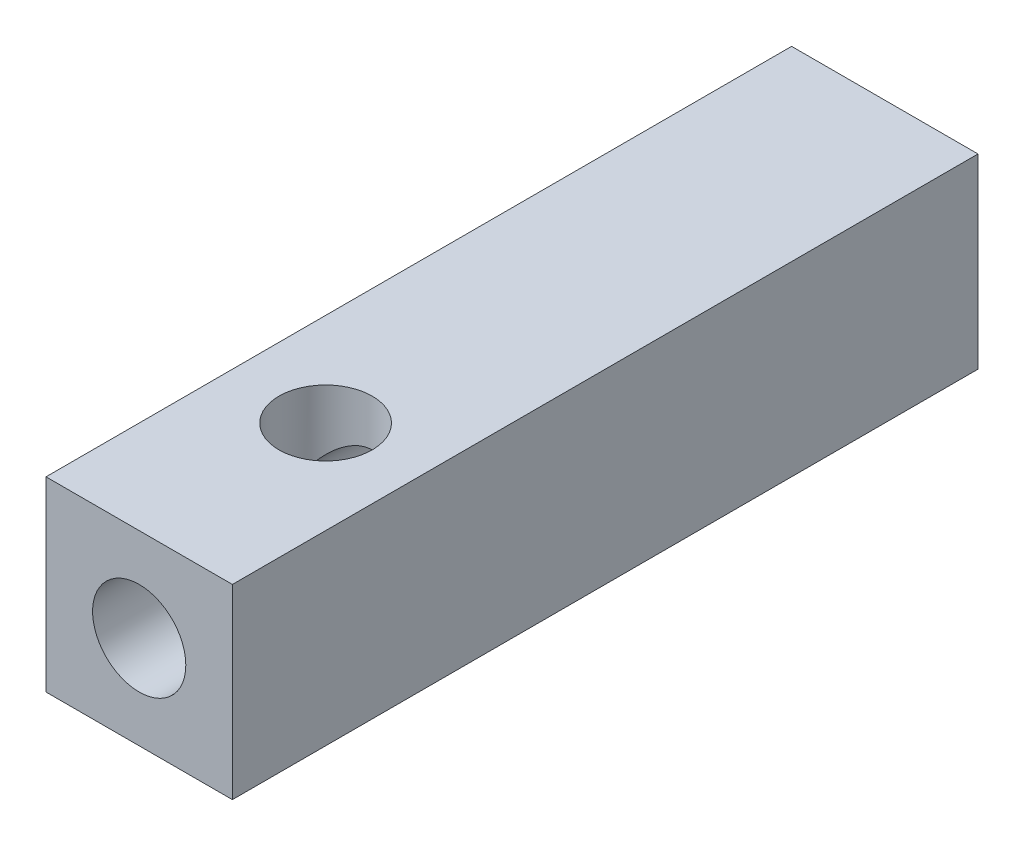
ISO-10303-21;
HEADER;
FILE_DESCRIPTION(('STEP AP214'),'2;1');
FILE_NAME('part.step','',(''),(''),'','','');
FILE_SCHEMA(('AUTOMOTIVE_DESIGN { 1 0 10303 214 1 1 1 1 }'));
ENDSEC;
DATA;
#1=APPLICATION_CONTEXT('core data for automotive mechanical design processes');
#2=APPLICATION_PROTOCOL_DEFINITION('international standard','automotive_design',2000,#1);
#3=PRODUCT_CONTEXT('',#1,'mechanical');
#4=PRODUCT('Part','Part','',(#3));
#5=PRODUCT_RELATED_PRODUCT_CATEGORY('part','',(#4));
#6=PRODUCT_DEFINITION_FORMATION('','',#4);
#7=PRODUCT_DEFINITION_CONTEXT('part definition',#1,'design');
#8=PRODUCT_DEFINITION('design','',#6,#7);
#9=PRODUCT_DEFINITION_SHAPE('','',#8);
#10=(LENGTH_UNIT() NAMED_UNIT(*) SI_UNIT(.MILLI.,.METRE.));
#11=(NAMED_UNIT(*) PLANE_ANGLE_UNIT() SI_UNIT($,.RADIAN.));
#12=(NAMED_UNIT(*) SI_UNIT($,.STERADIAN.) SOLID_ANGLE_UNIT());
#13=UNCERTAINTY_MEASURE_WITH_UNIT(LENGTH_MEASURE(1.E-05),#10,'distance_accuracy_value','');
#14=(GEOMETRIC_REPRESENTATION_CONTEXT(3) GLOBAL_UNCERTAINTY_ASSIGNED_CONTEXT((#13)) GLOBAL_UNIT_ASSIGNED_CONTEXT((#10,
#11,#12)) REPRESENTATION_CONTEXT('',''));
#15=CARTESIAN_POINT('',(0.,0.,0.));
#16=DIRECTION('',(0.,0.,1.));
#17=DIRECTION('',(1.,0.,0.));
#18=AXIS2_PLACEMENT_3D('',#15,#16,#17);
#19=CARTESIAN_POINT('',(-5.00000000000012,-5.00000000000142,39.9999999999999));
#20=DIRECTION('',(0.,0.,-1.00000000000001));
#21=DIRECTION('',(-0.999999999999996,0.,0.));
#22=AXIS2_PLACEMENT_3D('',#19,#20,#21);
#23=PLANE('',#22);
#24=DIRECTION('',(0.,1.,0.));
#25=VECTOR('',#24,1.);
#26=CARTESIAN_POINT('',(-5.00000000000012,-5.00000000000142,39.9999999999999));
#27=LINE('',#26,#25);
#28=CARTESIAN_POINT('',(-5.00000000000039,-15.0000000000028,39.9999999999999));
#29=VERTEX_POINT('',#28);
#30=CARTESIAN_POINT('',(-5.00000000000012,-5.00000000000142,39.9999999999999));
#31=VERTEX_POINT('',#30);
#32=EDGE_CURVE('E100',#29,#31,#27,.T.);
#33=ORIENTED_EDGE('',*,*,#32,.F.);
#34=DIRECTION('',(-0.999999999999996,0.,0.));
#35=VECTOR('',#34,1.);
#36=CARTESIAN_POINT('',(-5.00000000000039,-15.0000000000028,39.9999999999999));
#37=LINE('',#36,#35);
#38=CARTESIAN_POINT('',(4.99999999999956,-15.0000000000014,40.));
#39=VERTEX_POINT('',#38);
#40=EDGE_CURVE('E109',#39,#29,#37,.T.);
#41=ORIENTED_EDGE('',*,*,#40,.F.);
#42=DIRECTION('',(0.,-1.,0.));
#43=VECTOR('',#42,1.);
#44=CARTESIAN_POINT('',(4.99999999999978,-5.00000000000153,40.));
#45=LINE('',#44,#43);
#46=CARTESIAN_POINT('',(4.99999999999978,-5.00000000000153,40.));
#47=VERTEX_POINT('',#46);
#48=EDGE_CURVE('E106',#47,#39,#45,.T.);
#49=ORIENTED_EDGE('',*,*,#48,.F.);
#50=DIRECTION('',(0.999999999999996,0.,0.));
#51=VECTOR('',#50,1.);
#52=CARTESIAN_POINT('',(-5.00000000000012,-5.00000000000142,39.9999999999999));
#53=LINE('',#52,#51);
#54=EDGE_CURVE('E103',#31,#47,#53,.T.);
#55=ORIENTED_EDGE('',*,*,#54,.F.);
#56=EDGE_LOOP('',(#33,#41,#49,#55));
#57=FACE_BOUND('',#56,.T.);
#58=CARTESIAN_POINT('',(-2.77555756156289E-13,-9.9999999999999,40.0000000000038));
#59=DIRECTION('',(0.,0.,-1.00000000000001));
#60=DIRECTION('',(0.999999999999996,0.,0.));
#61=AXIS2_PLACEMENT_3D('',#58,#59,#60);
#62=CIRCLE('',#61,2.5);
#63=CARTESIAN_POINT('',(2.49999999999971,-9.99999999999989,40.0000000000037));
#64=VERTEX_POINT('',#63);
#65=EDGE_CURVE('E85',#64,#64,#62,.T.);
#66=ORIENTED_EDGE('',*,*,#65,.T.);
#67=EDGE_LOOP('',(#66));
#68=FACE_BOUND('',#67,.T.);
#69=ADVANCED_FACE('F16',(#57,#68),#23,.F.);
#70=CARTESIAN_POINT('',(-4.9999999999995,-5.00000000000259,6.85562717706034E-12));
#71=DIRECTION('',(0.,0.,-1.00000000000001));
#72=DIRECTION('',(-0.999999999999996,0.,0.));
#73=AXIS2_PLACEMENT_3D('',#70,#71,#72);
#74=PLANE('',#73);
#75=DIRECTION('',(0.,1.,0.));
#76=VECTOR('',#75,1.);
#77=CARTESIAN_POINT('',(-4.9999999999995,-5.00000000000259,6.85562717706034E-12));
#78=LINE('',#77,#76);
#79=CARTESIAN_POINT('',(-4.99999999999973,-15.000000000003,-6.93889390390723E-13));
#80=VERTEX_POINT('',#79);
#81=CARTESIAN_POINT('',(-4.9999999999995,-5.00000000000259,6.85562717706034E-12));
#82=VERTEX_POINT('',#81);
#83=EDGE_CURVE('E88',#80,#82,#78,.T.);
#84=ORIENTED_EDGE('',*,*,#83,.T.);
#85=DIRECTION('',(0.999999999999996,0.,0.));
#86=VECTOR('',#85,1.);
#87=CARTESIAN_POINT('',(-4.9999999999995,-5.00000000000259,6.85562717706034E-12));
#88=LINE('',#87,#86);
#89=CARTESIAN_POINT('',(5.00000000000073,-5.00000000000109,-4.8017145815038E-12));
#90=VERTEX_POINT('',#89);
#91=EDGE_CURVE('E91',#82,#90,#88,.T.);
#92=ORIENTED_EDGE('',*,*,#91,.T.);
#93=DIRECTION('',(0.,-1.,0.));
#94=VECTOR('',#93,1.);
#95=CARTESIAN_POINT('',(5.00000000000073,-5.00000000000109,-4.8017145815038E-12));
#96=LINE('',#95,#94);
#97=CARTESIAN_POINT('',(5.00000000000023,-15.0000000000023,-1.02695629777827E-12));
#98=VERTEX_POINT('',#97);
#99=EDGE_CURVE('E94',#90,#98,#96,.T.);
#100=ORIENTED_EDGE('',*,*,#99,.T.);
#101=DIRECTION('',(-0.999999999999996,0.,0.));
#102=VECTOR('',#101,1.);
#103=CARTESIAN_POINT('',(-4.99999999999973,-15.000000000003,-6.93889390390723E-13));
#104=LINE('',#103,#102);
#105=EDGE_CURVE('E97',#98,#80,#104,.T.);
#106=ORIENTED_EDGE('',*,*,#105,.T.);
#107=EDGE_LOOP('',(#84,#92,#100,#106));
#108=FACE_BOUND('',#107,.T.);
#109=CARTESIAN_POINT('',(4.44089209850063E-13,-10.0000000000009,3.05311331771918E-12));
#110=DIRECTION('',(0.,0.,-1.00000000000001));
#111=DIRECTION('',(0.999999999999996,0.,0.));
#112=AXIS2_PLACEMENT_3D('',#109,#110,#111);
#113=CIRCLE('',#112,2.5);
#114=CARTESIAN_POINT('',(2.50000000000043,-10.0000000000009,3.00433289357471E-12));
#115=VERTEX_POINT('',#114);
#116=EDGE_CURVE('E80',#115,#115,#113,.T.);
#117=ORIENTED_EDGE('',*,*,#116,.F.);
#118=EDGE_LOOP('',(#117));
#119=FACE_BOUND('',#118,.T.);
#120=ADVANCED_FACE('F130',(#108,#119),#74,.T.);
#121=CARTESIAN_POINT('',(-5.00000000000012,-5.00000000000142,39.9999999999999));
#122=DIRECTION('',(0.999999999999996,0.,0.));
#123=DIRECTION('',(0.,0.,-1.00000000000001));
#124=AXIS2_PLACEMENT_3D('',#121,#122,#123);
#125=PLANE('',#124);
#126=CARTESIAN_POINT('',(-4.9999999999995,-10.0000000000013,5.00000000000278));
#127=DIRECTION('',(-0.999999999999996,0.,0.));
#128=DIRECTION('',(0.,0.,-1.00000000000001));
#129=AXIS2_PLACEMENT_3D('',#126,#127,#128);
#130=CIRCLE('',#129,2.5);
#131=CARTESIAN_POINT('',(-4.99999999999946,-10.0000000000013,2.50000000000276));
#132=VERTEX_POINT('',#131);
#133=EDGE_CURVE('E77',#132,#132,#130,.T.);
#134=ORIENTED_EDGE('',*,*,#133,.F.);
#135=EDGE_LOOP('',(#134));
#136=FACE_BOUND('',#135,.T.);
#137=ORIENTED_EDGE('',*,*,#83,.F.);
#138=DIRECTION('',(0.,0.,-1.00000000000001));
#139=VECTOR('',#138,1.);
#140=CARTESIAN_POINT('',(-5.00000000000039,-15.0000000000028,39.9999999999999));
#141=LINE('',#140,#139);
#142=EDGE_CURVE('E112',#29,#80,#141,.T.);
#143=ORIENTED_EDGE('',*,*,#142,.F.);
#144=ORIENTED_EDGE('',*,*,#32,.T.);
#145=DIRECTION('',(0.,0.,-1.00000000000001));
#146=VECTOR('',#145,1.);
#147=CARTESIAN_POINT('',(-5.00000000000012,-5.00000000000142,39.9999999999999));
#148=LINE('',#147,#146);
#149=EDGE_CURVE('E118',#31,#82,#148,.T.);
#150=ORIENTED_EDGE('',*,*,#149,.T.);
#151=EDGE_LOOP('',(#137,#143,#144,#150));
#152=FACE_BOUND('',#151,.T.);
#153=ADVANCED_FACE('F18',(#136,#152),#125,.F.);
#154=CARTESIAN_POINT('',(-5.00000000000012,-5.00000000000142,39.9999999999999));
#155=DIRECTION('',(0.,-1.,0.));
#156=DIRECTION('',(0.,0.,1.00000000000001));
#157=AXIS2_PLACEMENT_3D('',#154,#155,#156);
#158=PLANE('',#157);
#159=CARTESIAN_POINT('',(0.,-5.00000000000214,29.9999999999999));
#160=DIRECTION('',(0.,1.,0.));
#161=DIRECTION('',(0.,0.,1.00000000000001));
#162=AXIS2_PLACEMENT_3D('',#159,#160,#161);
#163=CIRCLE('',#162,2.5);
#164=CARTESIAN_POINT('',(-1.04118103028128E-13,-5.00000000000214,32.5));
#165=VERTEX_POINT('',#164);
#166=EDGE_CURVE('E75',#165,#165,#163,.T.);
#167=ORIENTED_EDGE('',*,*,#166,.F.);
#168=EDGE_LOOP('',(#167));
#169=FACE_BOUND('',#168,.T.);
#170=ORIENTED_EDGE('',*,*,#91,.F.);
#171=ORIENTED_EDGE('',*,*,#149,.F.);
#172=ORIENTED_EDGE('',*,*,#54,.T.);
#173=DIRECTION('',(0.,0.,-1.00000000000001));
#174=VECTOR('',#173,1.);
#175=CARTESIAN_POINT('',(4.99999999999978,-5.00000000000153,40.));
#176=LINE('',#175,#174);
#177=EDGE_CURVE('E116',#47,#90,#176,.T.);
#178=ORIENTED_EDGE('',*,*,#177,.T.);
#179=EDGE_LOOP('',(#170,#171,#172,#178));
#180=FACE_BOUND('',#179,.T.);
#181=ADVANCED_FACE('F129',(#169,#180),#158,.F.);
#182=CARTESIAN_POINT('',(4.99999999999978,-5.00000000000153,40.));
#183=DIRECTION('',(-0.999999999999996,0.,0.));
#184=DIRECTION('',(0.,0.,1.00000000000001));
#185=AXIS2_PLACEMENT_3D('',#182,#183,#184);
#186=PLANE('',#185);
#187=ORIENTED_EDGE('',*,*,#99,.F.);
#188=ORIENTED_EDGE('',*,*,#177,.F.);
#189=ORIENTED_EDGE('',*,*,#48,.T.);
#190=DIRECTION('',(0.,0.,-1.00000000000001));
#191=VECTOR('',#190,1.);
#192=CARTESIAN_POINT('',(4.99999999999956,-15.0000000000014,40.));
#193=LINE('',#192,#191);
#194=EDGE_CURVE('E114',#39,#98,#193,.T.);
#195=ORIENTED_EDGE('',*,*,#194,.T.);
#196=EDGE_LOOP('',(#187,#188,#189,#195));
#197=FACE_BOUND('',#196,.T.);
#198=ADVANCED_FACE('F147',(#197),#186,.F.);
#199=CARTESIAN_POINT('',(-5.00000000000039,-15.0000000000028,39.9999999999999));
#200=DIRECTION('',(0.,1.,0.));
#201=DIRECTION('',(0.999999999999996,0.,0.));
#202=AXIS2_PLACEMENT_3D('',#199,#200,#201);
#203=PLANE('',#202);
#204=ORIENTED_EDGE('',*,*,#105,.F.);
#205=ORIENTED_EDGE('',*,*,#194,.F.);
#206=ORIENTED_EDGE('',*,*,#40,.T.);
#207=ORIENTED_EDGE('',*,*,#142,.T.);
#208=EDGE_LOOP('',(#204,#205,#206,#207));
#209=FACE_BOUND('',#208,.T.);
#210=ADVANCED_FACE('F138',(#209),#203,.F.);
#211=CARTESIAN_POINT('',(-2.77555756156289E-13,-9.9999999999999,40.0000000000038));
#212=DIRECTION('',(0.,0.,-1.00000000000001));
#213=DIRECTION('',(-0.999999999999996,0.,0.));
#214=AXIS2_PLACEMENT_3D('',#211,#212,#213);
#215=CYLINDRICAL_SURFACE('',#214,2.5);
#216=CARTESIAN_POINT('',(-2.22044604925031E-13,-10.000000000003,29.9999999999987));
#217=DIRECTION('',(0.,0.707106781186553,0.707106781186548));
#218=DIRECTION('',(0.,0.707106781186545,-0.707106781186552));
#219=AXIS2_PLACEMENT_3D('',#216,#217,#218);
#220=ELLIPSE('',#219,3.53553390593274,2.5);
#221=CARTESIAN_POINT('',(2.49999999999967,-10.0000000000029,29.9999999999991));
#222=VERTEX_POINT('',#221);
#223=CARTESIAN_POINT('',(-2.50000000000028,-9.99999999999918,30.000000000003));
#224=VERTEX_POINT('',#223);
#225=EDGE_CURVE('E11',#222,#224,#220,.T.);
#226=ORIENTED_EDGE('',*,*,#225,.T.);
#227=CARTESIAN_POINT('',(-2.22044604925031E-13,-10.000000000003,29.9999999999987));
#228=DIRECTION('',(0.,-0.707106781186545,0.707106781186552));
#229=DIRECTION('',(0.,-0.707106781186553,-0.707106781186548));
#230=AXIS2_PLACEMENT_3D('',#227,#228,#229);
#231=ELLIPSE('',#230,3.53553390593274,2.5);
#232=EDGE_CURVE('E24',#224,#222,#231,.F.);
#233=ORIENTED_EDGE('',*,*,#232,.T.);
#234=EDGE_LOOP('',(#226,#233));
#235=FACE_BOUND('',#234,.T.);
#236=CARTESIAN_POINT('',(0.,-10.0000000000014,5.00000000000039));
#237=DIRECTION('',(-0.707106781186553,0.,0.707106781186562));
#238=DIRECTION('',(-0.707106781186527,0.,-0.707106781186539));
#239=AXIS2_PLACEMENT_3D('',#236,#237,#238);
#240=ELLIPSE('',#239,3.53553390593274,2.5);
#241=CARTESIAN_POINT('',(4.44089209850063E-13,-7.50000000000126,4.99999999999995));
#242=VERTEX_POINT('',#241);
#243=CARTESIAN_POINT('',(0.,-12.5000000000013,5.00000000000408));
#244=VERTEX_POINT('',#243);
#245=EDGE_CURVE('E67',#242,#244,#240,.T.);
#246=ORIENTED_EDGE('',*,*,#245,.T.);
#247=CARTESIAN_POINT('',(0.,-10.0000000000014,5.00000000000039));
#248=DIRECTION('',(0.707106781186527,0.,0.707106781186539));
#249=DIRECTION('',(0.707106781186553,0.,-0.707106781186562));
#250=AXIS2_PLACEMENT_3D('',#247,#248,#249);
#251=ELLIPSE('',#250,3.53553390593274,2.5);
#252=EDGE_CURVE('E35',#244,#242,#251,.F.);
#253=ORIENTED_EDGE('',*,*,#252,.T.);
#254=EDGE_LOOP('',(#246,#253));
#255=FACE_BOUND('',#254,.T.);
#256=ORIENTED_EDGE('',*,*,#65,.F.);
#257=EDGE_LOOP('',(#256));
#258=FACE_BOUND('',#257,.T.);
#259=ORIENTED_EDGE('',*,*,#116,.T.);
#260=EDGE_LOOP('',(#259));
#261=FACE_BOUND('',#260,.T.);
#262=ADVANCED_FACE('F65',(#235,#255,#258,#261),#215,.F.);
#263=CARTESIAN_POINT('',(-4.9999999999995,-10.0000000000013,5.00000000000278));
#264=DIRECTION('',(0.999999999999996,0.,0.));
#265=DIRECTION('',(0.,0.,-1.00000000000001));
#266=AXIS2_PLACEMENT_3D('',#263,#264,#265);
#267=CYLINDRICAL_SURFACE('',#266,2.5);
#268=ORIENTED_EDGE('',*,*,#245,.F.);
#269=ORIENTED_EDGE('',*,*,#252,.F.);
#270=EDGE_LOOP('',(#268,#269));
#271=FACE_BOUND('',#270,.T.);
#272=ORIENTED_EDGE('',*,*,#133,.T.);
#273=EDGE_LOOP('',(#272));
#274=FACE_BOUND('',#273,.T.);
#275=ADVANCED_FACE('F71',(#271,#274),#267,.F.);
#276=CARTESIAN_POINT('',(0.,-5.00000000000214,29.9999999999999));
#277=DIRECTION('',(0.,-1.,0.));
#278=DIRECTION('',(0.,0.,1.00000000000001));
#279=AXIS2_PLACEMENT_3D('',#276,#277,#278);
#280=CYLINDRICAL_SURFACE('',#279,2.5);
#281=ORIENTED_EDGE('',*,*,#225,.F.);
#282=ORIENTED_EDGE('',*,*,#232,.F.);
#283=EDGE_LOOP('',(#281,#282));
#284=FACE_BOUND('',#283,.T.);
#285=ORIENTED_EDGE('',*,*,#166,.T.);
#286=EDGE_LOOP('',(#285));
#287=FACE_BOUND('',#286,.T.);
#288=ADVANCED_FACE('F68',(#284,#287),#280,.F.);
#289=CLOSED_SHELL('',(#69,#120,#153,#181,#198,#210,#262,#275,#288));
#290=MANIFOLD_SOLID_BREP('B1',#289);
#291=ADVANCED_BREP_SHAPE_REPRESENTATION('',(#18,#290),#14);
#292=SHAPE_DEFINITION_REPRESENTATION(#9,#291);
ENDSEC;
END-ISO-10303-21;
